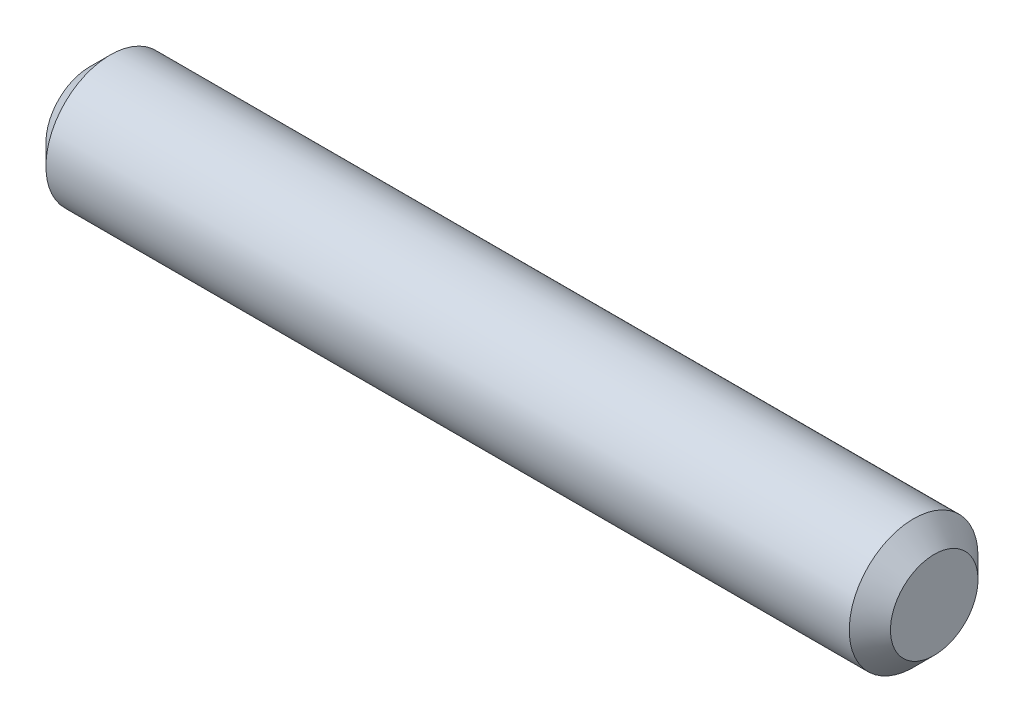
ISO-10303-21;
HEADER;
FILE_DESCRIPTION(('STEP AP214'),'2;1');
FILE_NAME('part.step','',(''),(''),'','','');
FILE_SCHEMA(('AUTOMOTIVE_DESIGN { 1 0 10303 214 1 1 1 1 }'));
ENDSEC;
DATA;
#1=APPLICATION_CONTEXT('core data for automotive mechanical design processes');
#2=APPLICATION_PROTOCOL_DEFINITION('international standard','automotive_design',2000,#1);
#3=PRODUCT_CONTEXT('',#1,'mechanical');
#4=PRODUCT('Part','Part','',(#3));
#5=PRODUCT_RELATED_PRODUCT_CATEGORY('part','',(#4));
#6=PRODUCT_DEFINITION_FORMATION('','',#4);
#7=PRODUCT_DEFINITION_CONTEXT('part definition',#1,'design');
#8=PRODUCT_DEFINITION('design','',#6,#7);
#9=PRODUCT_DEFINITION_SHAPE('','',#8);
#10=(LENGTH_UNIT() NAMED_UNIT(*) SI_UNIT(.MILLI.,.METRE.));
#11=(NAMED_UNIT(*) PLANE_ANGLE_UNIT() SI_UNIT($,.RADIAN.));
#12=(NAMED_UNIT(*) SI_UNIT($,.STERADIAN.) SOLID_ANGLE_UNIT());
#13=UNCERTAINTY_MEASURE_WITH_UNIT(LENGTH_MEASURE(1.E-05),#10,'distance_accuracy_value','');
#14=(GEOMETRIC_REPRESENTATION_CONTEXT(3) GLOBAL_UNCERTAINTY_ASSIGNED_CONTEXT((#13)) GLOBAL_UNIT_ASSIGNED_CONTEXT((#10,
#11,#12)) REPRESENTATION_CONTEXT('',''));
#15=CARTESIAN_POINT('',(0.,0.,0.));
#16=DIRECTION('',(0.,0.,1.));
#17=DIRECTION('',(1.,0.,0.));
#18=AXIS2_PLACEMENT_3D('',#15,#16,#17);
#19=CARTESIAN_POINT('',(10.414,0.,0.));
#20=DIRECTION('',(-1.,0.,0.));
#21=DIRECTION('',(0.,0.,1.));
#22=AXIS2_PLACEMENT_3D('',#19,#20,#21);
#23=CYLINDRICAL_SURFACE('',#22,1.5875);
#24=CARTESIAN_POINT('',(-9.906,0.,0.));
#25=DIRECTION('',(1.,0.,0.));
#26=DIRECTION('',(0.,0.,-1.));
#27=AXIS2_PLACEMENT_3D('',#24,#25,#26);
#28=CIRCLE('',#27,1.5875);
#29=CARTESIAN_POINT('',(-9.906,0.,-1.5875));
#30=VERTEX_POINT('',#29);
#31=EDGE_CURVE('E54',#30,#30,#28,.T.);
#32=ORIENTED_EDGE('',*,*,#31,.T.);
#33=EDGE_LOOP('',(#32));
#34=FACE_BOUND('',#33,.T.);
#35=CARTESIAN_POINT('',(9.906,0.,0.));
#36=DIRECTION('',(1.,0.,0.));
#37=DIRECTION('',(0.,0.,-1.));
#38=AXIS2_PLACEMENT_3D('',#35,#36,#37);
#39=CIRCLE('',#38,1.5875);
#40=CARTESIAN_POINT('',(9.906,0.,-1.5875));
#41=VERTEX_POINT('',#40);
#42=EDGE_CURVE('E58',#41,#41,#39,.F.);
#43=ORIENTED_EDGE('',*,*,#42,.T.);
#44=EDGE_LOOP('',(#43));
#45=FACE_BOUND('',#44,.T.);
#46=ADVANCED_FACE('F43',(#34,#45),#23,.T.);
#47=CARTESIAN_POINT('',(10.414,0.,0.));
#48=DIRECTION('',(1.,0.,0.));
#49=DIRECTION('',(0.,0.,-1.));
#50=AXIS2_PLACEMENT_3D('',#47,#48,#49);
#51=PLANE('',#50);
#52=CARTESIAN_POINT('',(10.414,0.,0.));
#53=DIRECTION('',(1.,0.,0.));
#54=DIRECTION('',(0.,0.,-1.));
#55=AXIS2_PLACEMENT_3D('',#52,#53,#54);
#56=CIRCLE('',#55,1.0795);
#57=CARTESIAN_POINT('',(10.414,0.,-1.0795));
#58=VERTEX_POINT('',#57);
#59=EDGE_CURVE('E12',#58,#58,#56,.T.);
#60=ORIENTED_EDGE('',*,*,#59,.T.);
#61=EDGE_LOOP('',(#60));
#62=FACE_BOUND('',#61,.T.);
#63=ADVANCED_FACE('F74',(#62),#51,.T.);
#64=CARTESIAN_POINT('',(-10.414,0.,0.));
#65=DIRECTION('',(1.,0.,0.));
#66=DIRECTION('',(0.,0.,-1.));
#67=AXIS2_PLACEMENT_3D('',#64,#65,#66);
#68=PLANE('',#67);
#69=CARTESIAN_POINT('',(-10.414,0.,0.));
#70=DIRECTION('',(1.,0.,0.));
#71=DIRECTION('',(0.,0.,-1.));
#72=AXIS2_PLACEMENT_3D('',#69,#70,#71);
#73=CIRCLE('',#72,1.0795);
#74=CARTESIAN_POINT('',(-10.414,0.,-1.0795));
#75=VERTEX_POINT('',#74);
#76=EDGE_CURVE('E50',#75,#75,#73,.F.);
#77=ORIENTED_EDGE('',*,*,#76,.T.);
#78=EDGE_LOOP('',(#77));
#79=FACE_BOUND('',#78,.T.);
#80=ADVANCED_FACE('F71',(#79),#68,.F.);
#81=CARTESIAN_POINT('',(-9.906,0.,0.));
#82=DIRECTION('',(1.,0.,0.));
#83=DIRECTION('',(0.,0.,-1.));
#84=AXIS2_PLACEMENT_3D('',#81,#82,#83);
#85=CONICAL_SURFACE('',#84,1.5875,0.785398163397449);
#86=ORIENTED_EDGE('',*,*,#76,.F.);
#87=EDGE_LOOP('',(#86));
#88=FACE_BOUND('',#87,.T.);
#89=ORIENTED_EDGE('',*,*,#31,.F.);
#90=EDGE_LOOP('',(#89));
#91=FACE_BOUND('',#90,.T.);
#92=ADVANCED_FACE('F67',(#88,#91),#85,.T.);
#93=CARTESIAN_POINT('',(10.414,0.,0.));
#94=DIRECTION('',(-1.,0.,0.));
#95=DIRECTION('',(0.,0.,1.));
#96=AXIS2_PLACEMENT_3D('',#93,#94,#95);
#97=CONICAL_SURFACE('',#96,1.0795,0.785398163397445);
#98=ORIENTED_EDGE('',*,*,#42,.F.);
#99=EDGE_LOOP('',(#98));
#100=FACE_BOUND('',#99,.T.);
#101=ORIENTED_EDGE('',*,*,#59,.F.);
#102=EDGE_LOOP('',(#101));
#103=FACE_BOUND('',#102,.T.);
#104=ADVANCED_FACE('F45',(#100,#103),#97,.T.);
#105=CLOSED_SHELL('',(#46,#63,#80,#92,#104));
#106=MANIFOLD_SOLID_BREP('B2',#105);
#107=ADVANCED_BREP_SHAPE_REPRESENTATION('',(#18,#106),#14);
#108=SHAPE_DEFINITION_REPRESENTATION(#9,#107);
ENDSEC;
END-ISO-10303-21;
